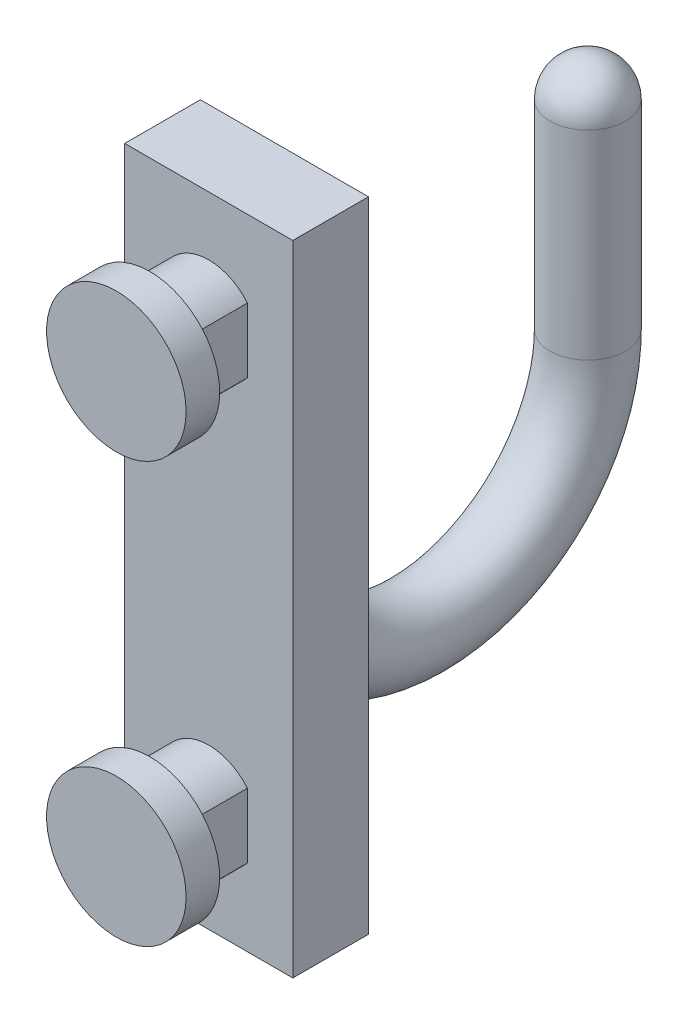
ISO-10303-21;
HEADER;
FILE_DESCRIPTION(('STEP AP214'),'2;1');
FILE_NAME('part.step','',(''),(''),'','','');
FILE_SCHEMA(('AUTOMOTIVE_DESIGN { 1 0 10303 214 1 1 1 1 }'));
ENDSEC;
DATA;
#1=APPLICATION_CONTEXT('core data for automotive mechanical design processes');
#2=APPLICATION_PROTOCOL_DEFINITION('international standard','automotive_design',2000,#1);
#3=PRODUCT_CONTEXT('',#1,'mechanical');
#4=PRODUCT('Part','Part','',(#3));
#5=PRODUCT_RELATED_PRODUCT_CATEGORY('part','',(#4));
#6=PRODUCT_DEFINITION_FORMATION('','',#4);
#7=PRODUCT_DEFINITION_CONTEXT('part definition',#1,'design');
#8=PRODUCT_DEFINITION('design','',#6,#7);
#9=PRODUCT_DEFINITION_SHAPE('','',#8);
#10=(LENGTH_UNIT() NAMED_UNIT(*) SI_UNIT(.MILLI.,.METRE.));
#11=(NAMED_UNIT(*) PLANE_ANGLE_UNIT() SI_UNIT($,.RADIAN.));
#12=(NAMED_UNIT(*) SI_UNIT($,.STERADIAN.) SOLID_ANGLE_UNIT());
#13=UNCERTAINTY_MEASURE_WITH_UNIT(LENGTH_MEASURE(1.E-05),#10,'distance_accuracy_value','');
#14=(GEOMETRIC_REPRESENTATION_CONTEXT(3) GLOBAL_UNCERTAINTY_ASSIGNED_CONTEXT((#13)) GLOBAL_UNIT_ASSIGNED_CONTEXT((#10,
#11,#12)) REPRESENTATION_CONTEXT('',''));
#15=CARTESIAN_POINT('',(0.,0.,0.));
#16=DIRECTION('',(0.,0.,1.));
#17=DIRECTION('',(1.,0.,0.));
#18=AXIS2_PLACEMENT_3D('',#15,#16,#17);
#19=CARTESIAN_POINT('',(0.,0.,0.));
#20=DIRECTION('',(0.,0.,-1.));
#21=DIRECTION('',(-1.,0.,0.));
#22=AXIS2_PLACEMENT_3D('',#19,#20,#21);
#23=PLANE('',#22);
#24=DIRECTION('',(0.,-1.,0.));
#25=VECTOR('',#24,1.);
#26=CARTESIAN_POINT('',(5.,6.5,0.));
#27=LINE('',#26,#25);
#28=CARTESIAN_POINT('',(5.,6.5,0.));
#29=VERTEX_POINT('',#28);
#30=CARTESIAN_POINT('',(5.,-31.5,0.));
#31=VERTEX_POINT('',#30);
#32=EDGE_CURVE('E209',#29,#31,#27,.T.);
#33=ORIENTED_EDGE('',*,*,#32,.F.);
#34=DIRECTION('',(1.,0.,0.));
#35=VECTOR('',#34,1.);
#36=CARTESIAN_POINT('',(5.,6.5,0.));
#37=LINE('',#36,#35);
#38=CARTESIAN_POINT('',(-5.,6.5,0.));
#39=VERTEX_POINT('',#38);
#40=EDGE_CURVE('E215',#39,#29,#37,.T.);
#41=ORIENTED_EDGE('',*,*,#40,.F.);
#42=DIRECTION('',(0.,1.,0.));
#43=VECTOR('',#42,1.);
#44=CARTESIAN_POINT('',(-5.,6.5,0.));
#45=LINE('',#44,#43);
#46=CARTESIAN_POINT('',(-5.,-31.5,0.));
#47=VERTEX_POINT('',#46);
#48=EDGE_CURVE('E231',#47,#39,#45,.T.);
#49=ORIENTED_EDGE('',*,*,#48,.F.);
#50=DIRECTION('',(-1.,0.,0.));
#51=VECTOR('',#50,1.);
#52=CARTESIAN_POINT('',(5.,-31.5,0.));
#53=LINE('',#52,#51);
#54=EDGE_CURVE('E228',#31,#47,#53,.T.);
#55=ORIENTED_EDGE('',*,*,#54,.F.);
#56=EDGE_LOOP('',(#33,#41,#49,#55));
#57=FACE_BOUND('',#56,.T.);
#58=CARTESIAN_POINT('',(0.,0.,0.));
#59=DIRECTION('',(0.,0.,1.));
#60=DIRECTION('',(1.,0.,0.));
#61=AXIS2_PLACEMENT_3D('',#58,#59,#60);
#62=CIRCLE('',#61,3.);
#63=CARTESIAN_POINT('',(2.3,1.92613602842582,0.));
#64=VERTEX_POINT('',#63);
#65=CARTESIAN_POINT('',(-2.3,1.92613602842582,0.));
#66=VERTEX_POINT('',#65);
#67=EDGE_CURVE('E256',#64,#66,#62,.T.);
#68=ORIENTED_EDGE('',*,*,#67,.F.);
#69=DIRECTION('',(0.,1.,0.));
#70=VECTOR('',#69,1.);
#71=CARTESIAN_POINT('',(2.3,1.92613602842582,0.));
#72=LINE('',#71,#70);
#73=CARTESIAN_POINT('',(2.3,-1.92613602842582,0.));
#74=VERTEX_POINT('',#73);
#75=EDGE_CURVE('E265',#74,#64,#72,.T.);
#76=ORIENTED_EDGE('',*,*,#75,.F.);
#77=CARTESIAN_POINT('',(0.,0.,0.));
#78=DIRECTION('',(0.,0.,1.));
#79=DIRECTION('',(1.,0.,0.));
#80=AXIS2_PLACEMENT_3D('',#77,#78,#79);
#81=CIRCLE('',#80,3.);
#82=CARTESIAN_POINT('',(-2.3,-1.92613602842582,0.));
#83=VERTEX_POINT('',#82);
#84=EDGE_CURVE('E285',#83,#74,#81,.T.);
#85=ORIENTED_EDGE('',*,*,#84,.F.);
#86=DIRECTION('',(0.,-1.,0.));
#87=VECTOR('',#86,1.);
#88=CARTESIAN_POINT('',(-2.3,1.92613602842582,0.));
#89=LINE('',#88,#87);
#90=EDGE_CURVE('E281',#66,#83,#89,.T.);
#91=ORIENTED_EDGE('',*,*,#90,.F.);
#92=EDGE_LOOP('',(#68,#76,#85,#91));
#93=FACE_BOUND('',#92,.T.);
#94=CARTESIAN_POINT('',(0.,-25.,0.));
#95=DIRECTION('',(0.,0.,1.));
#96=DIRECTION('',(1.,0.,0.));
#97=AXIS2_PLACEMENT_3D('',#94,#95,#96);
#98=CIRCLE('',#97,3.);
#99=CARTESIAN_POINT('',(2.3,-23.0738639715742,0.));
#100=VERTEX_POINT('',#99);
#101=CARTESIAN_POINT('',(-2.3,-23.0738639715742,0.));
#102=VERTEX_POINT('',#101);
#103=EDGE_CURVE('E163',#100,#102,#98,.T.);
#104=ORIENTED_EDGE('',*,*,#103,.F.);
#105=DIRECTION('',(0.,1.,0.));
#106=VECTOR('',#105,1.);
#107=CARTESIAN_POINT('',(2.3,-23.0738639715742,0.));
#108=LINE('',#107,#106);
#109=CARTESIAN_POINT('',(2.3,-26.9261360284258,0.));
#110=VERTEX_POINT('',#109);
#111=EDGE_CURVE('E172',#110,#100,#108,.T.);
#112=ORIENTED_EDGE('',*,*,#111,.F.);
#113=CARTESIAN_POINT('',(0.,-25.,0.));
#114=DIRECTION('',(0.,0.,1.));
#115=DIRECTION('',(1.,0.,0.));
#116=AXIS2_PLACEMENT_3D('',#113,#114,#115);
#117=CIRCLE('',#116,3.);
#118=CARTESIAN_POINT('',(-2.3,-26.9261360284258,0.));
#119=VERTEX_POINT('',#118);
#120=EDGE_CURVE('E70',#119,#110,#117,.T.);
#121=ORIENTED_EDGE('',*,*,#120,.F.);
#122=DIRECTION('',(0.,-1.,0.));
#123=VECTOR('',#122,1.);
#124=CARTESIAN_POINT('',(-2.3,-23.0738639715742,0.));
#125=LINE('',#124,#123);
#126=EDGE_CURVE('E65',#102,#119,#125,.T.);
#127=ORIENTED_EDGE('',*,*,#126,.F.);
#128=EDGE_LOOP('',(#104,#112,#121,#127));
#129=FACE_BOUND('',#128,.T.);
#130=ADVANCED_FACE('F43',(#57,#93,#129),#23,.F.);
#131=CARTESIAN_POINT('',(0.,0.,3.5));
#132=DIRECTION('',(0.,0.,-1.));
#133=DIRECTION('',(-1.,0.,0.));
#134=AXIS2_PLACEMENT_3D('',#131,#132,#133);
#135=CYLINDRICAL_SURFACE('',#134,3.);
#136=ORIENTED_EDGE('',*,*,#67,.T.);
#137=DIRECTION('',(0.,0.,-1.));
#138=VECTOR('',#137,1.);
#139=CARTESIAN_POINT('',(-2.3,1.92613602842582,3.5));
#140=LINE('',#139,#138);
#141=CARTESIAN_POINT('',(-2.3,1.92613602842582,3.5));
#142=VERTEX_POINT('',#141);
#143=EDGE_CURVE('E58',#142,#66,#140,.T.);
#144=ORIENTED_EDGE('',*,*,#143,.F.);
#145=CARTESIAN_POINT('',(0.,0.,3.5));
#146=DIRECTION('',(0.,0.,1.));
#147=DIRECTION('',(1.,0.,0.));
#148=AXIS2_PLACEMENT_3D('',#145,#146,#147);
#149=CIRCLE('',#148,3.);
#150=CARTESIAN_POINT('',(2.3,1.92613602842582,3.5));
#151=VERTEX_POINT('',#150);
#152=EDGE_CURVE('E260',#151,#142,#149,.T.);
#153=ORIENTED_EDGE('',*,*,#152,.F.);
#154=DIRECTION('',(0.,0.,-1.));
#155=VECTOR('',#154,1.);
#156=CARTESIAN_POINT('',(2.3,1.92613602842582,3.5));
#157=LINE('',#156,#155);
#158=EDGE_CURVE('E277',#151,#64,#157,.T.);
#159=ORIENTED_EDGE('',*,*,#158,.T.);
#160=EDGE_LOOP('',(#136,#144,#153,#159));
#161=FACE_BOUND('',#160,.T.);
#162=ADVANCED_FACE('F45',(#161),#135,.T.);
#163=CARTESIAN_POINT('',(-2.3,1.92613602842582,3.5));
#164=DIRECTION('',(1.,0.,0.));
#165=DIRECTION('',(0.,0.,-1.));
#166=AXIS2_PLACEMENT_3D('',#163,#164,#165);
#167=PLANE('',#166);
#168=ORIENTED_EDGE('',*,*,#90,.T.);
#169=DIRECTION('',(0.,0.,-1.));
#170=VECTOR('',#169,1.);
#171=CARTESIAN_POINT('',(-2.3,-1.92613602842582,3.5));
#172=LINE('',#171,#170);
#173=CARTESIAN_POINT('',(-2.3,-1.92613602842582,3.5));
#174=VERTEX_POINT('',#173);
#175=EDGE_CURVE('E298',#174,#83,#172,.T.);
#176=ORIENTED_EDGE('',*,*,#175,.F.);
#177=DIRECTION('',(0.,-1.,0.));
#178=VECTOR('',#177,1.);
#179=CARTESIAN_POINT('',(-2.3,1.92613602842582,3.5));
#180=LINE('',#179,#178);
#181=EDGE_CURVE('E264',#142,#174,#180,.T.);
#182=ORIENTED_EDGE('',*,*,#181,.F.);
#183=ORIENTED_EDGE('',*,*,#143,.T.);
#184=EDGE_LOOP('',(#168,#176,#182,#183));
#185=FACE_BOUND('',#184,.T.);
#186=ADVANCED_FACE('F305',(#185),#167,.F.);
#187=CARTESIAN_POINT('',(0.,0.,3.5));
#188=DIRECTION('',(0.,0.,-1.));
#189=DIRECTION('',(-1.,0.,0.));
#190=AXIS2_PLACEMENT_3D('',#187,#188,#189);
#191=CYLINDRICAL_SURFACE('',#190,3.);
#192=ORIENTED_EDGE('',*,*,#84,.T.);
#193=DIRECTION('',(0.,0.,-1.));
#194=VECTOR('',#193,1.);
#195=CARTESIAN_POINT('',(2.3,-1.92613602842582,3.5));
#196=LINE('',#195,#194);
#197=CARTESIAN_POINT('',(2.3,-1.92613602842582,3.5));
#198=VERTEX_POINT('',#197);
#199=EDGE_CURVE('E294',#198,#74,#196,.T.);
#200=ORIENTED_EDGE('',*,*,#199,.F.);
#201=CARTESIAN_POINT('',(0.,0.,3.5));
#202=DIRECTION('',(0.,0.,1.));
#203=DIRECTION('',(1.,0.,0.));
#204=AXIS2_PLACEMENT_3D('',#201,#202,#203);
#205=CIRCLE('',#204,3.);
#206=EDGE_CURVE('E269',#174,#198,#205,.T.);
#207=ORIENTED_EDGE('',*,*,#206,.F.);
#208=ORIENTED_EDGE('',*,*,#175,.T.);
#209=EDGE_LOOP('',(#192,#200,#207,#208));
#210=FACE_BOUND('',#209,.T.);
#211=ADVANCED_FACE('F315',(#210),#191,.T.);
#212=CARTESIAN_POINT('',(2.3,1.92613602842582,3.5));
#213=DIRECTION('',(-1.,0.,0.));
#214=DIRECTION('',(0.,0.,1.));
#215=AXIS2_PLACEMENT_3D('',#212,#213,#214);
#216=PLANE('',#215);
#217=ORIENTED_EDGE('',*,*,#75,.T.);
#218=ORIENTED_EDGE('',*,*,#158,.F.);
#219=DIRECTION('',(0.,1.,0.));
#220=VECTOR('',#219,1.);
#221=CARTESIAN_POINT('',(2.3,1.92613602842582,3.5));
#222=LINE('',#221,#220);
#223=EDGE_CURVE('E273',#198,#151,#222,.T.);
#224=ORIENTED_EDGE('',*,*,#223,.F.);
#225=ORIENTED_EDGE('',*,*,#199,.T.);
#226=EDGE_LOOP('',(#217,#218,#224,#225));
#227=FACE_BOUND('',#226,.T.);
#228=ADVANCED_FACE('F311',(#227),#216,.F.);
#229=CARTESIAN_POINT('',(0.,0.,3.5));
#230=DIRECTION('',(0.,0.,1.));
#231=DIRECTION('',(1.,0.,0.));
#232=AXIS2_PLACEMENT_3D('',#229,#230,#231);
#233=PLANE('',#232);
#234=CARTESIAN_POINT('',(0.,0.,3.5));
#235=DIRECTION('',(0.,0.,1.));
#236=DIRECTION('',(1.,0.,0.));
#237=AXIS2_PLACEMENT_3D('',#234,#235,#236);
#238=CIRCLE('',#237,4.15);
#239=CARTESIAN_POINT('',(4.15,0.,3.5));
#240=VERTEX_POINT('',#239);
#241=EDGE_CURVE('E251',#240,#240,#238,.T.);
#242=ORIENTED_EDGE('',*,*,#241,.F.);
#243=EDGE_LOOP('',(#242));
#244=FACE_BOUND('',#243,.T.);
#245=ORIENTED_EDGE('',*,*,#223,.T.);
#246=ORIENTED_EDGE('',*,*,#152,.T.);
#247=ORIENTED_EDGE('',*,*,#181,.T.);
#248=ORIENTED_EDGE('',*,*,#206,.T.);
#249=EDGE_LOOP('',(#245,#246,#247,#248));
#250=FACE_BOUND('',#249,.T.);
#251=ADVANCED_FACE('F317',(#244,#250),#233,.F.);
#252=CARTESIAN_POINT('',(0.,0.,5.5));
#253=DIRECTION('',(0.,0.,-1.));
#254=DIRECTION('',(-1.,0.,0.));
#255=AXIS2_PLACEMENT_3D('',#252,#253,#254);
#256=CYLINDRICAL_SURFACE('',#255,4.15);
#257=CARTESIAN_POINT('',(0.,0.,5.5));
#258=DIRECTION('',(0.,0.,1.));
#259=DIRECTION('',(1.,0.,0.));
#260=AXIS2_PLACEMENT_3D('',#257,#258,#259);
#261=CIRCLE('',#260,4.15);
#262=CARTESIAN_POINT('',(4.15,0.,5.5));
#263=VERTEX_POINT('',#262);
#264=EDGE_CURVE('E252',#263,#263,#261,.T.);
#265=ORIENTED_EDGE('',*,*,#264,.F.);
#266=EDGE_LOOP('',(#265));
#267=FACE_BOUND('',#266,.T.);
#268=ORIENTED_EDGE('',*,*,#241,.T.);
#269=EDGE_LOOP('',(#268));
#270=FACE_BOUND('',#269,.T.);
#271=ADVANCED_FACE('F319',(#267,#270),#256,.T.);
#272=CARTESIAN_POINT('',(0.,0.,5.5));
#273=DIRECTION('',(0.,0.,1.));
#274=DIRECTION('',(1.,0.,0.));
#275=AXIS2_PLACEMENT_3D('',#272,#273,#274);
#276=PLANE('',#275);
#277=ORIENTED_EDGE('',*,*,#264,.T.);
#278=EDGE_LOOP('',(#277));
#279=FACE_BOUND('',#278,.T.);
#280=ADVANCED_FACE('F326',(#279),#276,.T.);
#281=CARTESIAN_POINT('',(5.,6.5,-4.5));
#282=DIRECTION('',(-1.,0.,0.));
#283=DIRECTION('',(0.,-1.,0.));
#284=AXIS2_PLACEMENT_3D('',#281,#282,#283);
#285=PLANE('',#284);
#286=ORIENTED_EDGE('',*,*,#32,.T.);
#287=DIRECTION('',(0.,0.,1.));
#288=VECTOR('',#287,1.);
#289=CARTESIAN_POINT('',(5.,-31.5,-4.5));
#290=LINE('',#289,#288);
#291=CARTESIAN_POINT('',(5.,-31.5,-4.5));
#292=VERTEX_POINT('',#291);
#293=EDGE_CURVE('E247',#292,#31,#290,.T.);
#294=ORIENTED_EDGE('',*,*,#293,.F.);
#295=DIRECTION('',(0.,-1.,0.));
#296=VECTOR('',#295,1.);
#297=CARTESIAN_POINT('',(5.,6.5,-4.5));
#298=LINE('',#297,#296);
#299=CARTESIAN_POINT('',(5.,6.5,-4.5));
#300=VERTEX_POINT('',#299);
#301=EDGE_CURVE('E210',#300,#292,#298,.T.);
#302=ORIENTED_EDGE('',*,*,#301,.F.);
#303=DIRECTION('',(0.,0.,1.));
#304=VECTOR('',#303,1.);
#305=CARTESIAN_POINT('',(5.,6.5,-4.5));
#306=LINE('',#305,#304);
#307=EDGE_CURVE('E224',#300,#29,#306,.T.);
#308=ORIENTED_EDGE('',*,*,#307,.T.);
#309=EDGE_LOOP('',(#286,#294,#302,#308));
#310=FACE_BOUND('',#309,.T.);
#311=ADVANCED_FACE('F353',(#310),#285,.F.);
#312=CARTESIAN_POINT('',(5.,-31.5,-4.5));
#313=DIRECTION('',(0.,1.,0.));
#314=DIRECTION('',(0.,0.,1.));
#315=AXIS2_PLACEMENT_3D('',#312,#313,#314);
#316=PLANE('',#315);
#317=ORIENTED_EDGE('',*,*,#54,.T.);
#318=DIRECTION('',(0.,0.,1.));
#319=VECTOR('',#318,1.);
#320=CARTESIAN_POINT('',(-5.,-31.5,-4.5));
#321=LINE('',#320,#319);
#322=CARTESIAN_POINT('',(-5.,-31.5,-4.5));
#323=VERTEX_POINT('',#322);
#324=EDGE_CURVE('E243',#323,#47,#321,.T.);
#325=ORIENTED_EDGE('',*,*,#324,.F.);
#326=DIRECTION('',(-1.,0.,0.));
#327=VECTOR('',#326,1.);
#328=CARTESIAN_POINT('',(5.,-31.5,-4.5));
#329=LINE('',#328,#327);
#330=EDGE_CURVE('E214',#292,#323,#329,.T.);
#331=ORIENTED_EDGE('',*,*,#330,.F.);
#332=ORIENTED_EDGE('',*,*,#293,.T.);
#333=EDGE_LOOP('',(#317,#325,#331,#332));
#334=FACE_BOUND('',#333,.T.);
#335=ADVANCED_FACE('F349',(#334),#316,.F.);
#336=CARTESIAN_POINT('',(-5.,6.5,-4.5));
#337=DIRECTION('',(1.,0.,0.));
#338=DIRECTION('',(0.,1.,0.));
#339=AXIS2_PLACEMENT_3D('',#336,#337,#338);
#340=PLANE('',#339);
#341=ORIENTED_EDGE('',*,*,#48,.T.);
#342=DIRECTION('',(0.,0.,1.));
#343=VECTOR('',#342,1.);
#344=CARTESIAN_POINT('',(-5.,6.5,-4.5));
#345=LINE('',#344,#343);
#346=CARTESIAN_POINT('',(-5.,6.5,-4.5));
#347=VERTEX_POINT('',#346);
#348=EDGE_CURVE('E239',#347,#39,#345,.T.);
#349=ORIENTED_EDGE('',*,*,#348,.F.);
#350=DIRECTION('',(0.,1.,0.));
#351=VECTOR('',#350,1.);
#352=CARTESIAN_POINT('',(-5.,6.5,-4.5));
#353=LINE('',#352,#351);
#354=EDGE_CURVE('E218',#323,#347,#353,.T.);
#355=ORIENTED_EDGE('',*,*,#354,.F.);
#356=ORIENTED_EDGE('',*,*,#324,.T.);
#357=EDGE_LOOP('',(#341,#349,#355,#356));
#358=FACE_BOUND('',#357,.T.);
#359=ADVANCED_FACE('F345',(#358),#340,.F.);
#360=CARTESIAN_POINT('',(5.,6.5,-4.5));
#361=DIRECTION('',(0.,-1.,0.));
#362=DIRECTION('',(1.,0.,0.));
#363=AXIS2_PLACEMENT_3D('',#360,#361,#362);
#364=PLANE('',#363);
#365=ORIENTED_EDGE('',*,*,#40,.T.);
#366=ORIENTED_EDGE('',*,*,#307,.F.);
#367=DIRECTION('',(1.,0.,0.));
#368=VECTOR('',#367,1.);
#369=CARTESIAN_POINT('',(5.,6.5,-4.5));
#370=LINE('',#369,#368);
#371=EDGE_CURVE('E221',#347,#300,#370,.T.);
#372=ORIENTED_EDGE('',*,*,#371,.F.);
#373=ORIENTED_EDGE('',*,*,#348,.T.);
#374=EDGE_LOOP('',(#365,#366,#372,#373));
#375=FACE_BOUND('',#374,.T.);
#376=ADVANCED_FACE('F342',(#375),#364,.F.);
#377=CARTESIAN_POINT('',(0.,0.,-4.5));
#378=DIRECTION('',(0.,0.,-1.));
#379=DIRECTION('',(-1.,0.,0.));
#380=AXIS2_PLACEMENT_3D('',#377,#378,#379);
#381=PLANE('',#380);
#382=CARTESIAN_POINT('',(0.,-11.85,-4.5));
#383=CARTESIAN_POINT('',(0.000123142472977169,-11.84999999799,-4.5));
#384=CARTESIAN_POINT('',(0.000246284958717827,-11.8503817237463,-4.5));
#385=CARTESIAN_POINT('',(0.0005887706134919,-11.8512435412811,-4.5));
#386=CARTESIAN_POINT('',(0.000808146134366373,-11.8515676798553,-4.5));
#387=CARTESIAN_POINT('',(0.00164114559942172,-11.8529188457162,-4.5));
#388=CARTESIAN_POINT('',(0.00225397124880652,-11.8541612522636,-4.5));
#389=CARTESIAN_POINT('',(0.00469994630458368,-11.8589927931597,-4.5));
#390=CARTESIAN_POINT('',(0.00653477964703745,-11.8623320546203,-4.5));
#391=CARTESIAN_POINT('',(0.0320513385542506,-11.9089324830748,-4.5));
#392=CARTESIAN_POINT('',(0.0557191858945538,-11.954099433363,-4.5));
#393=CARTESIAN_POINT('',(0.103346189442953,-12.0440204457169,-4.5));
#394=CARTESIAN_POINT('',(0.127305176617037,-12.0887617229571,-4.5));
#395=CARTESIAN_POINT('',(0.199439002419618,-12.2238903662429,-4.5));
#396=CARTESIAN_POINT('',(0.247552847257771,-12.3145945982811,-4.5));
#397=CARTESIAN_POINT('',(0.34165726891542,-12.4925245895752,-4.5));
#398=CARTESIAN_POINT('',(0.38765923701018,-12.5797519627629,-4.5));
#399=CARTESIAN_POINT('',(0.47908242140288,-12.7541755057182,-4.5));
#400=CARTESIAN_POINT('',(0.524505099614309,-12.8413707321256,-4.5));
#401=CARTESIAN_POINT('',(0.619610427554623,-13.0253515174712,-4.5));
#402=CARTESIAN_POINT('',(0.669230676376501,-13.1221679760055,-4.5));
#403=CARTESIAN_POINT('',(0.767646907385362,-13.3163410182527,-4.5));
#404=CARTESIAN_POINT('',(0.816442038782984,-13.4136980365359,-4.5));
#405=CARTESIAN_POINT('',(0.962067945022369,-13.7082723226305,-4.5));
#406=CARTESIAN_POINT('',(1.05725968057334,-13.9063080447553,-4.5));
#407=CARTESIAN_POINT('',(1.22018049966221,-14.2589183281862,-4.5));
#408=CARTESIAN_POINT('',(1.28915669206386,-14.4129149883435,-4.5));
#409=CARTESIAN_POINT('',(1.42252162668456,-14.7224884034065,-4.5));
#410=CARTESIAN_POINT('',(1.48692018657314,-14.8780609055648,-4.5));
#411=CARTESIAN_POINT('',(1.60916974533297,-15.1882834221038,-4.5));
#412=CARTESIAN_POINT('',(1.66712357825907,-15.3428927203011,-4.5));
#413=CARTESIAN_POINT('',(1.77694245391676,-15.6543425167286,-4.5));
#414=CARTESIAN_POINT('',(1.82880514725661,-15.8111838498889,-4.5));
#415=CARTESIAN_POINT('',(1.91707909104827,-16.1000667761712,-4.5));
#416=CARTESIAN_POINT('',(1.9546160616358,-16.2317634375703,-4.5));
#417=CARTESIAN_POINT('',(2.02418686990435,-16.4971314173572,-4.5));
#418=CARTESIAN_POINT('',(2.05619991195221,-16.6308082252098,-4.5));
#419=CARTESIAN_POINT('',(2.11499295509571,-16.9051738566146,-4.5));
#420=CARTESIAN_POINT('',(2.14149828570769,-17.0459222196394,-4.5));
#421=CARTESIAN_POINT('',(2.18653837190011,-17.328550727625,-4.5));
#422=CARTESIAN_POINT('',(2.20508137045031,-17.4704295464946,-4.5));
#423=CARTESIAN_POINT('',(2.233095051041,-17.7544134372067,-4.5));
#424=CARTESIAN_POINT('',(2.24261026342591,-17.8965138986228,-4.5));
#425=CARTESIAN_POINT('',(2.25155773507052,-18.181042432696,-4.5));
#426=CARTESIAN_POINT('',(2.25098559597733,-18.3234706211864,-4.5));
#427=CARTESIAN_POINT('',(2.23230715204642,-18.7465742065984,-4.5));
#428=CARTESIAN_POINT('',(2.19769206999607,-19.0270103653044,-4.5));
#429=CARTESIAN_POINT('',(2.09740843639015,-19.4668878097806,-4.5));
#430=CARTESIAN_POINT('',(2.0493883495908,-19.6303988041605,-4.5));
#431=CARTESIAN_POINT('',(1.93005656457245,-19.9492375657483,-4.5));
#432=CARTESIAN_POINT('',(1.85871710554864,-20.1045553220174,-4.5));
#433=CARTESIAN_POINT('',(1.7055126016044,-20.3743502377641,-4.5));
#434=CARTESIAN_POINT('',(1.62779844197832,-20.491169063138,-4.5));
#435=CARTESIAN_POINT('',(1.45445575392089,-20.7106568716808,-4.5));
#436=CARTESIAN_POINT('',(1.3588579175881,-20.8133495818687,-4.5));
#437=CARTESIAN_POINT('',(1.17079849294803,-20.9809800983419,-4.5));
#438=CARTESIAN_POINT('',(1.08142330793349,-21.0493706721081,-4.5));
#439=CARTESIAN_POINT('',(0.892567143345563,-21.1705342654152,-4.5));
#440=CARTESIAN_POINT('',(0.793089819331233,-21.2233129074284,-4.5));
#441=CARTESIAN_POINT('',(0.585557258521239,-21.310539166578,-4.5));
#442=CARTESIAN_POINT('',(0.477450952647676,-21.3448666654296,-4.5));
#443=CARTESIAN_POINT('',(0.256669391130823,-21.3922940341217,-4.5));
#444=CARTESIAN_POINT('',(0.143996816301663,-21.4054061794171,-4.5));
#445=CARTESIAN_POINT('',(-0.0692276637318258,-21.4092483879153,-4.5));
#446=CARTESIAN_POINT('',(-0.169744408633844,-21.4022896366436,-4.5));
#447=CARTESIAN_POINT('',(-0.368080474982178,-21.3712833616639,-4.5));
#448=CARTESIAN_POINT('',(-0.465900132526169,-21.3472379772969,-4.5));
#449=CARTESIAN_POINT('',(-0.654750658907335,-21.2839047679794,-4.5));
#450=CARTESIAN_POINT('',(-0.745862447879464,-21.2448555718822,-4.5));
#451=CARTESIAN_POINT('',(-0.92105811614574,-21.1533903877792,-4.5));
#452=CARTESIAN_POINT('',(-1.00514077706033,-21.1009720888194,-4.5));
#453=CARTESIAN_POINT('',(-1.17324104085098,-20.9789502958904,-4.5));
#454=CARTESIAN_POINT('',(-1.25637847548543,-20.9081397489261,-4.5));
#455=CARTESIAN_POINT('',(-1.41194292703833,-20.7555984558632,-4.5));
#456=CARTESIAN_POINT('',(-1.48435931604063,-20.6738570245563,-4.5));
#457=CARTESIAN_POINT('',(-1.65303160719932,-20.4573797391654,-4.5));
#458=CARTESIAN_POINT('',(-1.74222074209464,-20.31711641814,-4.5));
#459=CARTESIAN_POINT('',(-1.89671394517022,-20.0243440141124,-4.5));
#460=CARTESIAN_POINT('',(-1.96201038757944,-19.8718310403266,-4.5));
#461=CARTESIAN_POINT('',(-2.09410051605468,-19.4935283019849,-4.5));
#462=CARTESIAN_POINT('',(-2.14993595046981,-19.2639364286068,-4.5));
#463=CARTESIAN_POINT('',(-2.22558062543512,-18.7967894524141,-4.5));
#464=CARTESIAN_POINT('',(-2.24497791432341,-18.5591738517584,-4.5));
#465=CARTESIAN_POINT('',(-2.25254487252134,-18.1268957679103,-4.5));
#466=CARTESIAN_POINT('',(-2.24574772583215,-17.9322727035464,-4.5));
#467=CARTESIAN_POINT('',(-2.2148645286365,-17.5441036543887,-4.5));
#468=CARTESIAN_POINT('',(-2.19074668479357,-17.3505603108324,-4.5));
#469=CARTESIAN_POINT('',(-2.12925595938406,-16.9740174991583,-4.5));
#470=CARTESIAN_POINT('',(-2.09248344928652,-16.790917017006,-4.5));
#471=CARTESIAN_POINT('',(-2.00783630834345,-16.4282372767168,-4.5));
#472=CARTESIAN_POINT('',(-1.96001440557405,-16.2486455551603,-4.5));
#473=CARTESIAN_POINT('',(-1.85982369033666,-15.908769811947,-4.5));
#474=CARTESIAN_POINT('',(-1.80828587328271,-15.7482377389383,-4.5));
#475=CARTESIAN_POINT('',(-1.69865502828536,-15.4295167747379,-4.5));
#476=CARTESIAN_POINT('',(-1.64056477062833,-15.2713269250482,-4.5));
#477=CARTESIAN_POINT('',(-1.51760930409941,-14.953867046817,-4.5));
#478=CARTESIAN_POINT('',(-1.45262931458081,-14.7946417322373,-4.5));
#479=CARTESIAN_POINT('',(-1.31777121902754,-14.4778713566265,-4.5));
#480=CARTESIAN_POINT('',(-1.24788252180759,-14.3203308299767,-4.5));
#481=CARTESIAN_POINT('',(-1.08218636700289,-13.95887462014,-4.5));
#482=CARTESIAN_POINT('',(-0.985014388823581,-13.7555863870725,-4.5));
#483=CARTESIAN_POINT('',(-0.836167168794185,-13.4532798826327,-4.5));
#484=CARTESIAN_POINT('',(-0.786261853838,-13.3533807212154,-4.5));
#485=CARTESIAN_POINT('',(-0.685557132896469,-13.1541598440073,-4.5));
#486=CARTESIAN_POINT('',(-0.634758646386003,-13.0548376600598,-4.5));
#487=CARTESIAN_POINT('',(-0.537367060231129,-12.8661269280367,-4.5));
#488=CARTESIAN_POINT('',(-0.490841361335746,-12.7767049814692,-4.5));
#489=CARTESIAN_POINT('',(-0.397175594881559,-12.5978382958909,-4.5));
#490=CARTESIAN_POINT('',(-0.350033950847306,-12.5083945644627,-4.5));
#491=CARTESIAN_POINT('',(-0.253582457663992,-12.3259503303661,-4.5));
#492=CARTESIAN_POINT('',(-0.204260332223886,-12.2329484724739,-4.5));
#493=CARTESIAN_POINT('',(-0.130309002113279,-12.0944010236921,-4.5));
#494=CARTESIAN_POINT('',(-0.105745353115537,-12.0485284688327,-4.5));
#495=CARTESIAN_POINT('',(-0.0569156457485735,-11.9563331379415,-4.5));
#496=CARTESIAN_POINT('',(-0.0326497733703581,-11.910023495924,-4.5));
#497=CARTESIAN_POINT('',(-0.00653474060962939,-11.8623321246327,-4.5));
#498=CARTESIAN_POINT('',(-0.0046998690488906,-11.8589926687397,-4.5));
#499=CARTESIAN_POINT('',(-0.00225388399552792,-11.8541610861916,-4.5));
#500=CARTESIAN_POINT('',(-0.00164108699685295,-11.852918746553,-4.5));
#501=CARTESIAN_POINT('',(-0.000808124251444747,-11.8515676360853,-4.5));
#502=CARTESIAN_POINT('',(-0.00058875665498334,-11.8512435069581,-4.5));
#503=CARTESIAN_POINT('',(-0.000246280950173991,-11.8503817194393,-4.5));
#504=CARTESIAN_POINT('',(-0.000123140481468534,-11.8500000020099,-4.5));
#505=CARTESIAN_POINT('',(0.,-11.85,-4.5));
#506=B_SPLINE_CURVE_WITH_KNOTS('',3,(#382,#383,#384,#385,#386,#387,#388,#389,#390,#391,#392,
#393,#394,#395,#396,#397,#398,#399,#400,#401,#402,#403,#404,#405,#406,#407,#408,#409,#410,#411,
#412,#413,#414,#415,#416,#417,#418,#419,#420,#421,#422,#423,#424,#425,#426,#427,#428,#429,#430,
#431,#432,#433,#434,#435,#436,#437,#438,#439,#440,#441,#442,#443,#444,#445,#446,#447,#448,#449,
#450,#451,#452,#453,#454,#455,#456,#457,#458,#459,#460,#461,#462,#463,#464,#465,#466,#467,#468,
#469,#470,#471,#472,#473,#474,#475,#476,#477,#478,#479,#480,#481,#482,#483,#484,#485,#486,#487,
#488,#489,#490,#491,#492,#493,#494,#495,#496,#497,#498,#499,#500,#501,#502,#503,#504,#505),
.UNSPECIFIED.,.T.,.F.,(4,2,2,2,2,2,2,2,2,2,2,2,2,2,2,2,2,2,2,2,2,2,2,2,2,2,2,2,2,2,2,2,2,2,2,2,
2,2,2,2,2,2,2,2,2,2,2,2,2,2,2,2,2,2,2,2,2,2,2,2,2,4),(0.,0.000784119071158776,
0.00218053944397092,0.00608934645350147,0.0177763890965032,0.168625488875335,0.321415024477518,
0.629016037239454,0.924965157845449,1.21988664452218,1.54626581101736,1.87296318272148,
2.53205857212554,3.03821912266716,3.54325913280195,4.03849532677084,4.53392191354024,
4.94463931846421,5.35687070488565,5.78633309767209,6.21534981316004,6.64223919257189,
7.06931471168099,7.91166669190467,8.42155615686468,8.93205484960255,9.35144324796828,
9.77011838434995,10.1063850268337,10.4425304185802,10.7808384217281,11.1189506057628,
11.4197349168776,11.7204815747647,12.0166307478307,12.3128311473327,12.6392222406198,
12.9659347538762,13.4617858788124,13.9577951255565,14.6627668947653,15.3756618494295,
15.9590377992012,16.5434873217673,17.1033472853756,17.6605888287671,18.1662343686893,
18.671666923946,19.1874961501774,19.7044747268992,20.3803358364233,20.7153434536573,
21.0500243388206,21.3523982171577,21.6558263540546,21.9712037070994,22.1278557937796,
22.2825167100616,22.2942039992601,22.2981126228951,22.2995089929625,22.3002930993526),.UNSPECIFIED.);
#507=CARTESIAN_POINT('',(0.,-11.85,-4.5));
#508=VERTEX_POINT('',#507);
#509=EDGE_CURVE('E11',#508,#508,#506,.T.);
#510=ORIENTED_EDGE('',*,*,#509,.F.);
#511=EDGE_LOOP('',(#510));
#512=FACE_BOUND('',#511,.T.);
#513=ORIENTED_EDGE('',*,*,#301,.T.);
#514=ORIENTED_EDGE('',*,*,#330,.T.);
#515=ORIENTED_EDGE('',*,*,#354,.T.);
#516=ORIENTED_EDGE('',*,*,#371,.T.);
#517=EDGE_LOOP('',(#513,#514,#515,#516));
#518=FACE_BOUND('',#517,.T.);
#519=ADVANCED_FACE('F138',(#512,#518),#381,.T.);
#520=CARTESIAN_POINT('',(0.,-25.,3.5));
#521=DIRECTION('',(0.,0.,-1.));
#522=DIRECTION('',(-1.,0.,0.));
#523=AXIS2_PLACEMENT_3D('',#520,#521,#522);
#524=CYLINDRICAL_SURFACE('',#523,3.);
#525=ORIENTED_EDGE('',*,*,#103,.T.);
#526=DIRECTION('',(0.,0.,-1.));
#527=VECTOR('',#526,1.);
#528=CARTESIAN_POINT('',(-2.3,-23.0738639715742,3.5));
#529=LINE('',#528,#527);
#530=CARTESIAN_POINT('',(-2.3,-23.0738639715742,3.5));
#531=VERTEX_POINT('',#530);
#532=EDGE_CURVE('E206',#531,#102,#529,.T.);
#533=ORIENTED_EDGE('',*,*,#532,.F.);
#534=CARTESIAN_POINT('',(0.,-25.,3.5));
#535=DIRECTION('',(0.,0.,1.));
#536=DIRECTION('',(1.,0.,0.));
#537=AXIS2_PLACEMENT_3D('',#534,#535,#536);
#538=CIRCLE('',#537,3.);
#539=CARTESIAN_POINT('',(2.3,-23.0738639715742,3.5));
#540=VERTEX_POINT('',#539);
#541=EDGE_CURVE('E167',#540,#531,#538,.T.);
#542=ORIENTED_EDGE('',*,*,#541,.F.);
#543=DIRECTION('',(0.,0.,-1.));
#544=VECTOR('',#543,1.);
#545=CARTESIAN_POINT('',(2.3,-23.0738639715742,3.5));
#546=LINE('',#545,#544);
#547=EDGE_CURVE('E184',#540,#100,#546,.T.);
#548=ORIENTED_EDGE('',*,*,#547,.T.);
#549=EDGE_LOOP('',(#525,#533,#542,#548));
#550=FACE_BOUND('',#549,.T.);
#551=ADVANCED_FACE('F387',(#550),#524,.T.);
#552=CARTESIAN_POINT('',(-2.3,-23.0738639715742,3.5));
#553=DIRECTION('',(1.,0.,0.));
#554=DIRECTION('',(0.,1.,0.));
#555=AXIS2_PLACEMENT_3D('',#552,#553,#554);
#556=PLANE('',#555);
#557=ORIENTED_EDGE('',*,*,#126,.T.);
#558=DIRECTION('',(0.,0.,-1.));
#559=VECTOR('',#558,1.);
#560=CARTESIAN_POINT('',(-2.3,-26.9261360284258,3.5));
#561=LINE('',#560,#559);
#562=CARTESIAN_POINT('',(-2.3,-26.9261360284258,3.5));
#563=VERTEX_POINT('',#562);
#564=EDGE_CURVE('E202',#563,#119,#561,.T.);
#565=ORIENTED_EDGE('',*,*,#564,.F.);
#566=DIRECTION('',(0.,-1.,0.));
#567=VECTOR('',#566,1.);
#568=CARTESIAN_POINT('',(-2.3,-23.0738639715742,3.5));
#569=LINE('',#568,#567);
#570=EDGE_CURVE('E171',#531,#563,#569,.T.);
#571=ORIENTED_EDGE('',*,*,#570,.F.);
#572=ORIENTED_EDGE('',*,*,#532,.T.);
#573=EDGE_LOOP('',(#557,#565,#571,#572));
#574=FACE_BOUND('',#573,.T.);
#575=ADVANCED_FACE('F393',(#574),#556,.F.);
#576=CARTESIAN_POINT('',(0.,-25.,3.5));
#577=DIRECTION('',(0.,0.,-1.));
#578=DIRECTION('',(-1.,0.,0.));
#579=AXIS2_PLACEMENT_3D('',#576,#577,#578);
#580=CYLINDRICAL_SURFACE('',#579,3.);
#581=ORIENTED_EDGE('',*,*,#120,.T.);
#582=DIRECTION('',(0.,0.,-1.));
#583=VECTOR('',#582,1.);
#584=CARTESIAN_POINT('',(2.3,-26.9261360284258,3.5));
#585=LINE('',#584,#583);
#586=CARTESIAN_POINT('',(2.3,-26.9261360284258,3.5));
#587=VERTEX_POINT('',#586);
#588=EDGE_CURVE('E198',#587,#110,#585,.T.);
#589=ORIENTED_EDGE('',*,*,#588,.F.);
#590=CARTESIAN_POINT('',(0.,-25.,3.5));
#591=DIRECTION('',(0.,0.,1.));
#592=DIRECTION('',(1.,0.,0.));
#593=AXIS2_PLACEMENT_3D('',#590,#591,#592);
#594=CIRCLE('',#593,3.);
#595=EDGE_CURVE('E176',#563,#587,#594,.T.);
#596=ORIENTED_EDGE('',*,*,#595,.F.);
#597=ORIENTED_EDGE('',*,*,#564,.T.);
#598=EDGE_LOOP('',(#581,#589,#596,#597));
#599=FACE_BOUND('',#598,.T.);
#600=ADVANCED_FACE('F400',(#599),#580,.T.);
#601=CARTESIAN_POINT('',(2.3,-23.0738639715742,3.5));
#602=DIRECTION('',(-1.,0.,0.));
#603=DIRECTION('',(0.,-1.,0.));
#604=AXIS2_PLACEMENT_3D('',#601,#602,#603);
#605=PLANE('',#604);
#606=ORIENTED_EDGE('',*,*,#111,.T.);
#607=ORIENTED_EDGE('',*,*,#547,.F.);
#608=DIRECTION('',(0.,1.,0.));
#609=VECTOR('',#608,1.);
#610=CARTESIAN_POINT('',(2.3,-23.0738639715742,3.5));
#611=LINE('',#610,#609);
#612=EDGE_CURVE('E180',#587,#540,#611,.T.);
#613=ORIENTED_EDGE('',*,*,#612,.F.);
#614=ORIENTED_EDGE('',*,*,#588,.T.);
#615=EDGE_LOOP('',(#606,#607,#613,#614));
#616=FACE_BOUND('',#615,.T.);
#617=ADVANCED_FACE('F408',(#616),#605,.F.);
#618=CARTESIAN_POINT('',(0.,-25.,3.5));
#619=DIRECTION('',(0.,0.,1.));
#620=DIRECTION('',(1.,0.,0.));
#621=AXIS2_PLACEMENT_3D('',#618,#619,#620);
#622=PLANE('',#621);
#623=CARTESIAN_POINT('',(0.,-25.,3.5));
#624=DIRECTION('',(0.,0.,1.));
#625=DIRECTION('',(1.,0.,0.));
#626=AXIS2_PLACEMENT_3D('',#623,#624,#625);
#627=CIRCLE('',#626,4.15);
#628=CARTESIAN_POINT('',(4.15,-25.,3.5));
#629=VERTEX_POINT('',#628);
#630=EDGE_CURVE('E156',#629,#629,#627,.T.);
#631=ORIENTED_EDGE('',*,*,#630,.F.);
#632=EDGE_LOOP('',(#631));
#633=FACE_BOUND('',#632,.T.);
#634=ORIENTED_EDGE('',*,*,#612,.T.);
#635=ORIENTED_EDGE('',*,*,#541,.T.);
#636=ORIENTED_EDGE('',*,*,#570,.T.);
#637=ORIENTED_EDGE('',*,*,#595,.T.);
#638=EDGE_LOOP('',(#634,#635,#636,#637));
#639=FACE_BOUND('',#638,.T.);
#640=ADVANCED_FACE('F416',(#633,#639),#622,.F.);
#641=CARTESIAN_POINT('',(0.,-25.,5.5));
#642=DIRECTION('',(0.,0.,-1.));
#643=DIRECTION('',(-1.,0.,0.));
#644=AXIS2_PLACEMENT_3D('',#641,#642,#643);
#645=CYLINDRICAL_SURFACE('',#644,4.15);
#646=CARTESIAN_POINT('',(0.,-25.,5.5));
#647=DIRECTION('',(0.,0.,1.));
#648=DIRECTION('',(1.,0.,0.));
#649=AXIS2_PLACEMENT_3D('',#646,#647,#648);
#650=CIRCLE('',#649,4.15);
#651=CARTESIAN_POINT('',(4.15,-25.,5.5));
#652=VERTEX_POINT('',#651);
#653=EDGE_CURVE('E159',#652,#652,#650,.T.);
#654=ORIENTED_EDGE('',*,*,#653,.F.);
#655=EDGE_LOOP('',(#654));
#656=FACE_BOUND('',#655,.T.);
#657=ORIENTED_EDGE('',*,*,#630,.T.);
#658=EDGE_LOOP('',(#657));
#659=FACE_BOUND('',#658,.T.);
#660=ADVANCED_FACE('F424',(#656,#659),#645,.T.);
#661=CARTESIAN_POINT('',(0.,-25.,5.5));
#662=DIRECTION('',(0.,0.,1.));
#663=DIRECTION('',(1.,0.,0.));
#664=AXIS2_PLACEMENT_3D('',#661,#662,#663);
#665=PLANE('',#664);
#666=ORIENTED_EDGE('',*,*,#653,.T.);
#667=EDGE_LOOP('',(#666));
#668=FACE_BOUND('',#667,.T.);
#669=ADVANCED_FACE('F145',(#668),#665,.T.);
#670=CARTESIAN_POINT('',(0.,-11.85,-12.4));
#671=DIRECTION('',(1.,0.,0.));
#672=DIRECTION('',(0.,0.,-1.));
#673=AXIS2_PLACEMENT_3D('',#670,#671,#672);
#674=TOROIDAL_SURFACE('',#673,10.15,2.25);
#675=ORIENTED_EDGE('',*,*,#509,.T.);
#676=EDGE_LOOP('',(#675));
#677=FACE_BOUND('',#676,.T.);
#678=CARTESIAN_POINT('',(0.,-11.85,-22.55));
#679=DIRECTION('',(0.,1.,0.));
#680=DIRECTION('',(-1.,0.,0.));
#681=AXIS2_PLACEMENT_3D('',#678,#679,#680);
#682=CIRCLE('',#681,2.25);
#683=CARTESIAN_POINT('',(-2.25,-11.85,-22.55));
#684=VERTEX_POINT('',#683);
#685=EDGE_CURVE('E149',#684,#684,#682,.T.);
#686=ORIENTED_EDGE('',*,*,#685,.F.);
#687=EDGE_LOOP('',(#686));
#688=FACE_BOUND('',#687,.T.);
#689=ADVANCED_FACE('F141',(#677,#688),#674,.T.);
#690=CARTESIAN_POINT('',(0.,-11.85,-22.55));
#691=DIRECTION('',(0.,1.,0.));
#692=DIRECTION('',(0.,0.,1.));
#693=AXIS2_PLACEMENT_3D('',#690,#691,#692);
#694=CYLINDRICAL_SURFACE('',#693,2.25);
#695=CARTESIAN_POINT('',(0.,0.,-22.55));
#696=DIRECTION('',(0.,1.,0.));
#697=DIRECTION('',(-1.,0.,0.));
#698=AXIS2_PLACEMENT_3D('',#695,#696,#697);
#699=CIRCLE('',#698,2.25);
#700=CARTESIAN_POINT('',(-2.25,0.,-22.55));
#701=VERTEX_POINT('',#700);
#702=EDGE_CURVE('E152',#701,#701,#699,.T.);
#703=ORIENTED_EDGE('',*,*,#702,.F.);
#704=EDGE_LOOP('',(#703));
#705=FACE_BOUND('',#704,.T.);
#706=ORIENTED_EDGE('',*,*,#685,.T.);
#707=EDGE_LOOP('',(#706));
#708=FACE_BOUND('',#707,.T.);
#709=ADVANCED_FACE('F144',(#705,#708),#694,.T.);
#710=CARTESIAN_POINT('',(0.,0.,-22.55));
#711=DIRECTION('',(0.,-1.,0.));
#712=DIRECTION('',(0.,0.,1.));
#713=AXIS2_PLACEMENT_3D('',#710,#711,#712);
#714=SPHERICAL_SURFACE('',#713,2.25);
#715=ORIENTED_EDGE('',*,*,#702,.T.);
#716=EDGE_LOOP('',(#715));
#717=FACE_BOUND('',#716,.T.);
#718=ADVANCED_FACE('F146',(#717),#714,.T.);
#719=CLOSED_SHELL('',(#130,#162,#186,#211,#228,#251,#271,#280,#311,#335,#359,#376,#519,#551,
#575,#600,#617,#640,#660,#669,#689,#709,#718));
#720=MANIFOLD_SOLID_BREP('B2',#719);
#721=ADVANCED_BREP_SHAPE_REPRESENTATION('',(#18,#720),#14);
#722=SHAPE_DEFINITION_REPRESENTATION(#9,#721);
ENDSEC;
END-ISO-10303-21;
